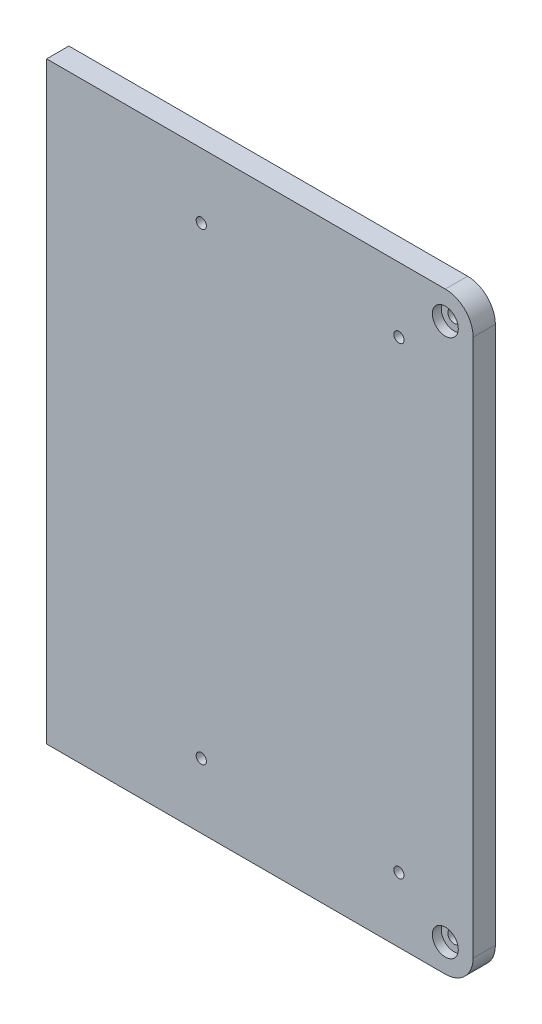
ISO-10303-21;
HEADER;
FILE_DESCRIPTION(('STEP AP214'),'2;1');
FILE_NAME('part.step','',(''),(''),'','','');
FILE_SCHEMA(('AUTOMOTIVE_DESIGN { 1 0 10303 214 1 1 1 1 }'));
ENDSEC;
DATA;
#1=APPLICATION_CONTEXT('core data for automotive mechanical design processes');
#2=APPLICATION_PROTOCOL_DEFINITION('international standard','automotive_design',2000,#1);
#3=PRODUCT_CONTEXT('',#1,'mechanical');
#4=PRODUCT('Part','Part','',(#3));
#5=PRODUCT_RELATED_PRODUCT_CATEGORY('part','',(#4));
#6=PRODUCT_DEFINITION_FORMATION('','',#4);
#7=PRODUCT_DEFINITION_CONTEXT('part definition',#1,'design');
#8=PRODUCT_DEFINITION('design','',#6,#7);
#9=PRODUCT_DEFINITION_SHAPE('','',#8);
#10=(LENGTH_UNIT() NAMED_UNIT(*) SI_UNIT(.MILLI.,.METRE.));
#11=(NAMED_UNIT(*) PLANE_ANGLE_UNIT() SI_UNIT($,.RADIAN.));
#12=(NAMED_UNIT(*) SI_UNIT($,.STERADIAN.) SOLID_ANGLE_UNIT());
#13=UNCERTAINTY_MEASURE_WITH_UNIT(LENGTH_MEASURE(1.E-05),#10,'distance_accuracy_value','');
#14=(GEOMETRIC_REPRESENTATION_CONTEXT(3) GLOBAL_UNCERTAINTY_ASSIGNED_CONTEXT((#13)) GLOBAL_UNIT_ASSIGNED_CONTEXT((#10,
#11,#12)) REPRESENTATION_CONTEXT('',''));
#15=CARTESIAN_POINT('',(0.,0.,0.));
#16=DIRECTION('',(0.,0.,1.));
#17=DIRECTION('',(1.,0.,0.));
#18=AXIS2_PLACEMENT_3D('',#15,#16,#17);
#19=CARTESIAN_POINT('',(-107.5,-80.,6.));
#20=DIRECTION('',(0.,1.,0.));
#21=DIRECTION('',(0.,0.,1.));
#22=AXIS2_PLACEMENT_3D('',#19,#20,#21);
#23=PLANE('',#22);
#24=DIRECTION('',(1.,0.,0.));
#25=VECTOR('',#24,1.);
#26=CARTESIAN_POINT('',(-107.5,-80.,6.));
#27=LINE('',#26,#25);
#28=CARTESIAN_POINT('',(0.,-80.,6.));
#29=VERTEX_POINT('',#28);
#30=CARTESIAN_POINT('',(107.5,-80.,6.));
#31=VERTEX_POINT('',#30);
#32=EDGE_CURVE('E84',#29,#31,#27,.T.);
#33=ORIENTED_EDGE('',*,*,#32,.F.);
#34=DIRECTION('',(0.,0.,-1.));
#35=VECTOR('',#34,1.);
#36=CARTESIAN_POINT('',(0.,-80.,10.));
#37=LINE('',#36,#35);
#38=CARTESIAN_POINT('',(0.,-80.,0.));
#39=VERTEX_POINT('',#38);
#40=EDGE_CURVE('E95',#29,#39,#37,.T.);
#41=ORIENTED_EDGE('',*,*,#40,.T.);
#42=DIRECTION('',(1.,0.,0.));
#43=VECTOR('',#42,1.);
#44=CARTESIAN_POINT('',(-107.5,-80.,0.));
#45=LINE('',#44,#43);
#46=CARTESIAN_POINT('',(107.5,-80.,0.));
#47=VERTEX_POINT('',#46);
#48=EDGE_CURVE('E102',#39,#47,#45,.T.);
#49=ORIENTED_EDGE('',*,*,#48,.T.);
#50=DIRECTION('',(0.,0.,-1.));
#51=VECTOR('',#50,1.);
#52=CARTESIAN_POINT('',(107.5,-80.,6.));
#53=LINE('',#52,#51);
#54=EDGE_CURVE('E11',#31,#47,#53,.T.);
#55=ORIENTED_EDGE('',*,*,#54,.F.);
#56=EDGE_LOOP('',(#33,#41,#49,#55));
#57=FACE_BOUND('',#56,.T.);
#58=ADVANCED_FACE('F33',(#57),#23,.F.);
#59=CARTESIAN_POINT('',(107.5,-72.5,6.));
#60=DIRECTION('',(0.,0.,-1.));
#61=DIRECTION('',(-1.,0.,0.));
#62=AXIS2_PLACEMENT_3D('',#59,#60,#61);
#63=CYLINDRICAL_SURFACE('',#62,7.5);
#64=CARTESIAN_POINT('',(107.5,-72.5,0.));
#65=DIRECTION('',(0.,0.,1.));
#66=DIRECTION('',(1.,0.,0.));
#67=AXIS2_PLACEMENT_3D('',#64,#65,#66);
#68=CIRCLE('',#67,7.5);
#69=CARTESIAN_POINT('',(115.,-72.5,0.));
#70=VERTEX_POINT('',#69);
#71=EDGE_CURVE('E108',#47,#70,#68,.T.);
#72=ORIENTED_EDGE('',*,*,#71,.T.);
#73=DIRECTION('',(0.,0.,-1.));
#74=VECTOR('',#73,1.);
#75=CARTESIAN_POINT('',(115.,-72.5,6.));
#76=LINE('',#75,#74);
#77=CARTESIAN_POINT('',(115.,-72.5,6.));
#78=VERTEX_POINT('',#77);
#79=EDGE_CURVE('E40',#78,#70,#76,.T.);
#80=ORIENTED_EDGE('',*,*,#79,.F.);
#81=CARTESIAN_POINT('',(107.5,-72.5,6.));
#82=DIRECTION('',(0.,0.,1.));
#83=DIRECTION('',(1.,0.,0.));
#84=AXIS2_PLACEMENT_3D('',#81,#82,#83);
#85=CIRCLE('',#84,7.5);
#86=EDGE_CURVE('E140',#31,#78,#85,.T.);
#87=ORIENTED_EDGE('',*,*,#86,.F.);
#88=ORIENTED_EDGE('',*,*,#54,.T.);
#89=EDGE_LOOP('',(#72,#80,#87,#88));
#90=FACE_BOUND('',#89,.T.);
#91=ADVANCED_FACE('F222',(#90),#63,.T.);
#92=CARTESIAN_POINT('',(115.,72.5,6.));
#93=DIRECTION('',(-1.,0.,0.));
#94=DIRECTION('',(0.,-1.,0.));
#95=AXIS2_PLACEMENT_3D('',#92,#93,#94);
#96=PLANE('',#95);
#97=DIRECTION('',(0.,1.,0.));
#98=VECTOR('',#97,1.);
#99=CARTESIAN_POINT('',(115.,72.5,0.));
#100=LINE('',#99,#98);
#101=CARTESIAN_POINT('',(115.,72.5,0.));
#102=VERTEX_POINT('',#101);
#103=EDGE_CURVE('E111',#70,#102,#100,.T.);
#104=ORIENTED_EDGE('',*,*,#103,.T.);
#105=DIRECTION('',(0.,0.,-1.));
#106=VECTOR('',#105,1.);
#107=CARTESIAN_POINT('',(115.,72.5,6.));
#108=LINE('',#107,#106);
#109=CARTESIAN_POINT('',(115.,72.5,6.));
#110=VERTEX_POINT('',#109);
#111=EDGE_CURVE('E126',#110,#102,#108,.T.);
#112=ORIENTED_EDGE('',*,*,#111,.F.);
#113=DIRECTION('',(0.,1.,0.));
#114=VECTOR('',#113,1.);
#115=CARTESIAN_POINT('',(115.,72.5,6.));
#116=LINE('',#115,#114);
#117=EDGE_CURVE('E133',#78,#110,#116,.T.);
#118=ORIENTED_EDGE('',*,*,#117,.F.);
#119=ORIENTED_EDGE('',*,*,#79,.T.);
#120=EDGE_LOOP('',(#104,#112,#118,#119));
#121=FACE_BOUND('',#120,.T.);
#122=ADVANCED_FACE('F131',(#121),#96,.F.);
#123=CARTESIAN_POINT('',(107.5,72.5,6.));
#124=DIRECTION('',(0.,0.,-1.));
#125=DIRECTION('',(-1.,0.,0.));
#126=AXIS2_PLACEMENT_3D('',#123,#124,#125);
#127=CYLINDRICAL_SURFACE('',#126,7.49999999999999);
#128=CARTESIAN_POINT('',(107.5,72.5,0.));
#129=DIRECTION('',(0.,0.,1.));
#130=DIRECTION('',(-1.,0.,0.));
#131=AXIS2_PLACEMENT_3D('',#128,#129,#130);
#132=CIRCLE('',#131,7.49999999999999);
#133=CARTESIAN_POINT('',(107.5,80.,0.));
#134=VERTEX_POINT('',#133);
#135=EDGE_CURVE('E77',#102,#134,#132,.T.);
#136=ORIENTED_EDGE('',*,*,#135,.T.);
#137=DIRECTION('',(0.,0.,-1.));
#138=VECTOR('',#137,1.);
#139=CARTESIAN_POINT('',(107.5,80.,6.));
#140=LINE('',#139,#138);
#141=CARTESIAN_POINT('',(107.5,80.,6.));
#142=VERTEX_POINT('',#141);
#143=EDGE_CURVE('E124',#142,#134,#140,.T.);
#144=ORIENTED_EDGE('',*,*,#143,.F.);
#145=CARTESIAN_POINT('',(107.5,72.5,6.));
#146=DIRECTION('',(0.,0.,1.));
#147=DIRECTION('',(-1.,0.,0.));
#148=AXIS2_PLACEMENT_3D('',#145,#146,#147);
#149=CIRCLE('',#148,7.49999999999999);
#150=EDGE_CURVE('E56',#110,#142,#149,.T.);
#151=ORIENTED_EDGE('',*,*,#150,.F.);
#152=ORIENTED_EDGE('',*,*,#111,.T.);
#153=EDGE_LOOP('',(#136,#144,#151,#152));
#154=FACE_BOUND('',#153,.T.);
#155=ADVANCED_FACE('F139',(#154),#127,.T.);
#156=CARTESIAN_POINT('',(-107.5,80.,6.));
#157=DIRECTION('',(0.,-1.,0.));
#158=DIRECTION('',(0.,0.,-1.));
#159=AXIS2_PLACEMENT_3D('',#156,#157,#158);
#160=PLANE('',#159);
#161=DIRECTION('',(-1.,0.,0.));
#162=VECTOR('',#161,1.);
#163=CARTESIAN_POINT('',(-107.5,80.,0.));
#164=LINE('',#163,#162);
#165=CARTESIAN_POINT('',(0.,80.,0.));
#166=VERTEX_POINT('',#165);
#167=EDGE_CURVE('E122',#134,#166,#164,.T.);
#168=ORIENTED_EDGE('',*,*,#167,.T.);
#169=DIRECTION('',(0.,0.,-1.));
#170=VECTOR('',#169,1.);
#171=CARTESIAN_POINT('',(0.,80.,10.));
#172=LINE('',#171,#170);
#173=CARTESIAN_POINT('',(0.,80.,6.));
#174=VERTEX_POINT('',#173);
#175=EDGE_CURVE('E47',#174,#166,#172,.T.);
#176=ORIENTED_EDGE('',*,*,#175,.F.);
#177=DIRECTION('',(-1.,0.,0.));
#178=VECTOR('',#177,1.);
#179=CARTESIAN_POINT('',(-107.5,80.,6.));
#180=LINE('',#179,#178);
#181=EDGE_CURVE('E117',#142,#174,#180,.T.);
#182=ORIENTED_EDGE('',*,*,#181,.F.);
#183=ORIENTED_EDGE('',*,*,#143,.T.);
#184=EDGE_LOOP('',(#168,#176,#182,#183));
#185=FACE_BOUND('',#184,.T.);
#186=ADVANCED_FACE('F137',(#185),#160,.F.);
#187=CARTESIAN_POINT('',(-107.5,-72.5,6.));
#188=DIRECTION('',(0.,0.,1.));
#189=DIRECTION('',(1.,0.,0.));
#190=AXIS2_PLACEMENT_3D('',#187,#188,#189);
#191=PLANE('',#190);
#192=DIRECTION('',(0.,1.,0.));
#193=VECTOR('',#192,1.);
#194=CARTESIAN_POINT('',(0.,-72.5,6.));
#195=LINE('',#194,#193);
#196=EDGE_CURVE('E103',#29,#174,#195,.T.);
#197=ORIENTED_EDGE('',*,*,#196,.F.);
#198=ORIENTED_EDGE('',*,*,#32,.T.);
#199=ORIENTED_EDGE('',*,*,#86,.T.);
#200=ORIENTED_EDGE('',*,*,#117,.T.);
#201=ORIENTED_EDGE('',*,*,#150,.T.);
#202=ORIENTED_EDGE('',*,*,#181,.T.);
#203=EDGE_LOOP('',(#197,#198,#199,#200,#201,#202));
#204=FACE_BOUND('',#203,.T.);
#205=CARTESIAN_POINT('',(107.5,-72.5,6.));
#206=DIRECTION('',(0.,0.,1.));
#207=DIRECTION('',(1.,0.,0.));
#208=AXIS2_PLACEMENT_3D('',#205,#206,#207);
#209=CIRCLE('',#208,3.5);
#210=CARTESIAN_POINT('',(111.,-72.5,6.));
#211=VERTEX_POINT('',#210);
#212=EDGE_CURVE('E186',#211,#211,#209,.T.);
#213=ORIENTED_EDGE('',*,*,#212,.F.);
#214=EDGE_LOOP('',(#213));
#215=FACE_BOUND('',#214,.T.);
#216=CARTESIAN_POINT('',(107.5,72.5,6.));
#217=DIRECTION('',(0.,0.,1.));
#218=DIRECTION('',(1.,0.,0.));
#219=AXIS2_PLACEMENT_3D('',#216,#217,#218);
#220=CIRCLE('',#219,3.5);
#221=CARTESIAN_POINT('',(111.,72.5,6.));
#222=VERTEX_POINT('',#221);
#223=EDGE_CURVE('E174',#222,#222,#220,.T.);
#224=ORIENTED_EDGE('',*,*,#223,.F.);
#225=EDGE_LOOP('',(#224));
#226=FACE_BOUND('',#225,.T.);
#227=CARTESIAN_POINT('',(95.,62.5,6.));
#228=DIRECTION('',(0.,0.,1.));
#229=DIRECTION('',(1.,0.,0.));
#230=AXIS2_PLACEMENT_3D('',#227,#228,#229);
#231=CIRCLE('',#230,1.375);
#232=CARTESIAN_POINT('',(96.375,62.5,6.));
#233=VERTEX_POINT('',#232);
#234=EDGE_CURVE('E147',#233,#233,#231,.T.);
#235=ORIENTED_EDGE('',*,*,#234,.F.);
#236=EDGE_LOOP('',(#235));
#237=FACE_BOUND('',#236,.T.);
#238=CARTESIAN_POINT('',(41.7,-62.5,6.));
#239=DIRECTION('',(0.,0.,1.));
#240=DIRECTION('',(1.,0.,0.));
#241=AXIS2_PLACEMENT_3D('',#238,#239,#240);
#242=CIRCLE('',#241,1.375);
#243=CARTESIAN_POINT('',(43.075,-62.5,6.));
#244=VERTEX_POINT('',#243);
#245=EDGE_CURVE('E150',#244,#244,#242,.T.);
#246=ORIENTED_EDGE('',*,*,#245,.F.);
#247=EDGE_LOOP('',(#246));
#248=FACE_BOUND('',#247,.T.);
#249=CARTESIAN_POINT('',(41.7,62.5,6.));
#250=DIRECTION('',(0.,0.,1.));
#251=DIRECTION('',(1.,0.,0.));
#252=AXIS2_PLACEMENT_3D('',#249,#250,#251);
#253=CIRCLE('',#252,1.375);
#254=CARTESIAN_POINT('',(43.075,62.5,6.));
#255=VERTEX_POINT('',#254);
#256=EDGE_CURVE('E153',#255,#255,#253,.T.);
#257=ORIENTED_EDGE('',*,*,#256,.F.);
#258=EDGE_LOOP('',(#257));
#259=FACE_BOUND('',#258,.T.);
#260=CARTESIAN_POINT('',(95.,-62.5,6.));
#261=DIRECTION('',(0.,0.,1.));
#262=DIRECTION('',(1.,0.,0.));
#263=AXIS2_PLACEMENT_3D('',#260,#261,#262);
#264=CIRCLE('',#263,1.375);
#265=CARTESIAN_POINT('',(96.375,-62.5,6.));
#266=VERTEX_POINT('',#265);
#267=EDGE_CURVE('E109',#266,#266,#264,.T.);
#268=ORIENTED_EDGE('',*,*,#267,.F.);
#269=EDGE_LOOP('',(#268));
#270=FACE_BOUND('',#269,.T.);
#271=ADVANCED_FACE('F190',(#204,#215,#226,#237,#248,#259,#270),#191,.T.);
#272=CARTESIAN_POINT('',(-107.5,-72.5,0.));
#273=DIRECTION('',(0.,0.,1.));
#274=DIRECTION('',(1.,0.,0.));
#275=AXIS2_PLACEMENT_3D('',#272,#273,#274);
#276=PLANE('',#275);
#277=CARTESIAN_POINT('',(107.5,-72.5,0.));
#278=DIRECTION('',(0.,0.,1.));
#279=DIRECTION('',(1.,0.,0.));
#280=AXIS2_PLACEMENT_3D('',#277,#278,#279);
#281=CIRCLE('',#280,1.69999999999999);
#282=CARTESIAN_POINT('',(109.2,-72.5,0.));
#283=VERTEX_POINT('',#282);
#284=EDGE_CURVE('E177',#283,#283,#281,.T.);
#285=ORIENTED_EDGE('',*,*,#284,.T.);
#286=EDGE_LOOP('',(#285));
#287=FACE_BOUND('',#286,.T.);
#288=CARTESIAN_POINT('',(107.5,72.5,0.));
#289=DIRECTION('',(0.,0.,1.));
#290=DIRECTION('',(1.,0.,0.));
#291=AXIS2_PLACEMENT_3D('',#288,#289,#290);
#292=CIRCLE('',#291,1.69999999999999);
#293=CARTESIAN_POINT('',(109.2,72.5,0.));
#294=VERTEX_POINT('',#293);
#295=EDGE_CURVE('E161',#294,#294,#292,.T.);
#296=ORIENTED_EDGE('',*,*,#295,.T.);
#297=EDGE_LOOP('',(#296));
#298=FACE_BOUND('',#297,.T.);
#299=CARTESIAN_POINT('',(95.,62.5,0.));
#300=DIRECTION('',(0.,0.,1.));
#301=DIRECTION('',(1.,0.,0.));
#302=AXIS2_PLACEMENT_3D('',#299,#300,#301);
#303=CIRCLE('',#302,1.375);
#304=CARTESIAN_POINT('',(96.375,62.5,0.));
#305=VERTEX_POINT('',#304);
#306=EDGE_CURVE('E156',#305,#305,#303,.T.);
#307=ORIENTED_EDGE('',*,*,#306,.T.);
#308=EDGE_LOOP('',(#307));
#309=FACE_BOUND('',#308,.T.);
#310=CARTESIAN_POINT('',(41.7,-62.5,0.));
#311=DIRECTION('',(0.,0.,1.));
#312=DIRECTION('',(1.,0.,0.));
#313=AXIS2_PLACEMENT_3D('',#310,#311,#312);
#314=CIRCLE('',#313,1.375);
#315=CARTESIAN_POINT('',(43.075,-62.5,0.));
#316=VERTEX_POINT('',#315);
#317=EDGE_CURVE('E160',#316,#316,#314,.T.);
#318=ORIENTED_EDGE('',*,*,#317,.T.);
#319=EDGE_LOOP('',(#318));
#320=FACE_BOUND('',#319,.T.);
#321=CARTESIAN_POINT('',(41.7,62.5,0.));
#322=DIRECTION('',(0.,0.,1.));
#323=DIRECTION('',(1.,0.,0.));
#324=AXIS2_PLACEMENT_3D('',#321,#322,#323);
#325=CIRCLE('',#324,1.375);
#326=CARTESIAN_POINT('',(43.075,62.5,0.));
#327=VERTEX_POINT('',#326);
#328=EDGE_CURVE('E157',#327,#327,#325,.T.);
#329=ORIENTED_EDGE('',*,*,#328,.T.);
#330=EDGE_LOOP('',(#329));
#331=FACE_BOUND('',#330,.T.);
#332=CARTESIAN_POINT('',(95.,-62.5,0.));
#333=DIRECTION('',(0.,0.,1.));
#334=DIRECTION('',(1.,0.,0.));
#335=AXIS2_PLACEMENT_3D('',#332,#333,#334);
#336=CIRCLE('',#335,1.375);
#337=CARTESIAN_POINT('',(96.375,-62.5,0.));
#338=VERTEX_POINT('',#337);
#339=EDGE_CURVE('E114',#338,#338,#336,.T.);
#340=ORIENTED_EDGE('',*,*,#339,.T.);
#341=EDGE_LOOP('',(#340));
#342=FACE_BOUND('',#341,.T.);
#343=ORIENTED_EDGE('',*,*,#48,.F.);
#344=DIRECTION('',(0.,-1.,0.));
#345=VECTOR('',#344,1.);
#346=CARTESIAN_POINT('',(0.,80.,0.));
#347=LINE('',#346,#345);
#348=EDGE_CURVE('E92',#166,#39,#347,.T.);
#349=ORIENTED_EDGE('',*,*,#348,.F.);
#350=ORIENTED_EDGE('',*,*,#167,.F.);
#351=ORIENTED_EDGE('',*,*,#135,.F.);
#352=ORIENTED_EDGE('',*,*,#103,.F.);
#353=ORIENTED_EDGE('',*,*,#71,.F.);
#354=EDGE_LOOP('',(#343,#349,#350,#351,#352,#353));
#355=FACE_BOUND('',#354,.T.);
#356=ADVANCED_FACE('F106',(#287,#298,#309,#320,#331,#342,#355),#276,.F.);
#357=CARTESIAN_POINT('',(95.,-62.5,0.));
#358=DIRECTION('',(0.,0.,1.));
#359=DIRECTION('',(1.,0.,0.));
#360=AXIS2_PLACEMENT_3D('',#357,#358,#359);
#361=CYLINDRICAL_SURFACE('',#360,1.375);
#362=ORIENTED_EDGE('',*,*,#267,.T.);
#363=EDGE_LOOP('',(#362));
#364=FACE_BOUND('',#363,.T.);
#365=ORIENTED_EDGE('',*,*,#339,.F.);
#366=EDGE_LOOP('',(#365));
#367=FACE_BOUND('',#366,.T.);
#368=ADVANCED_FACE('F206',(#364,#367),#361,.F.);
#369=CARTESIAN_POINT('',(41.7,62.5,0.));
#370=DIRECTION('',(0.,0.,1.));
#371=DIRECTION('',(1.,0.,0.));
#372=AXIS2_PLACEMENT_3D('',#369,#370,#371);
#373=CYLINDRICAL_SURFACE('',#372,1.375);
#374=ORIENTED_EDGE('',*,*,#256,.T.);
#375=EDGE_LOOP('',(#374));
#376=FACE_BOUND('',#375,.T.);
#377=ORIENTED_EDGE('',*,*,#328,.F.);
#378=EDGE_LOOP('',(#377));
#379=FACE_BOUND('',#378,.T.);
#380=ADVANCED_FACE('F209',(#376,#379),#373,.F.);
#381=CARTESIAN_POINT('',(41.7,-62.5,0.));
#382=DIRECTION('',(0.,0.,1.));
#383=DIRECTION('',(1.,0.,0.));
#384=AXIS2_PLACEMENT_3D('',#381,#382,#383);
#385=CYLINDRICAL_SURFACE('',#384,1.375);
#386=ORIENTED_EDGE('',*,*,#245,.T.);
#387=EDGE_LOOP('',(#386));
#388=FACE_BOUND('',#387,.T.);
#389=ORIENTED_EDGE('',*,*,#317,.F.);
#390=EDGE_LOOP('',(#389));
#391=FACE_BOUND('',#390,.T.);
#392=ADVANCED_FACE('F257',(#388,#391),#385,.F.);
#393=CARTESIAN_POINT('',(95.,62.5,0.));
#394=DIRECTION('',(0.,0.,1.));
#395=DIRECTION('',(1.,0.,0.));
#396=AXIS2_PLACEMENT_3D('',#393,#394,#395);
#397=CYLINDRICAL_SURFACE('',#396,1.375);
#398=ORIENTED_EDGE('',*,*,#234,.T.);
#399=EDGE_LOOP('',(#398));
#400=FACE_BOUND('',#399,.T.);
#401=ORIENTED_EDGE('',*,*,#306,.F.);
#402=EDGE_LOOP('',(#401));
#403=FACE_BOUND('',#402,.T.);
#404=ADVANCED_FACE('F265',(#400,#403),#397,.F.);
#405=CARTESIAN_POINT('',(107.5,72.5,6.));
#406=DIRECTION('',(0.,0.,1.));
#407=DIRECTION('',(1.,0.,0.));
#408=AXIS2_PLACEMENT_3D('',#405,#406,#407);
#409=CYLINDRICAL_SURFACE('',#408,1.7);
#410=ORIENTED_EDGE('',*,*,#295,.F.);
#411=EDGE_LOOP('',(#410));
#412=FACE_BOUND('',#411,.T.);
#413=CARTESIAN_POINT('',(107.5,72.5,3.6));
#414=DIRECTION('',(0.,0.,1.));
#415=DIRECTION('',(1.,0.,0.));
#416=AXIS2_PLACEMENT_3D('',#413,#414,#415);
#417=CIRCLE('',#416,1.70000000000001);
#418=CARTESIAN_POINT('',(109.2,72.5,3.6));
#419=VERTEX_POINT('',#418);
#420=EDGE_CURVE('E168',#419,#419,#417,.T.);
#421=ORIENTED_EDGE('',*,*,#420,.T.);
#422=EDGE_LOOP('',(#421));
#423=FACE_BOUND('',#422,.T.);
#424=ADVANCED_FACE('F273',(#412,#423),#409,.F.);
#425=CARTESIAN_POINT('',(109.2,72.5,3.6));
#426=DIRECTION('',(0.,0.,-1.));
#427=DIRECTION('',(-1.,0.,0.));
#428=AXIS2_PLACEMENT_3D('',#425,#426,#427);
#429=PLANE('',#428);
#430=ORIENTED_EDGE('',*,*,#420,.F.);
#431=EDGE_LOOP('',(#430));
#432=FACE_BOUND('',#431,.T.);
#433=CARTESIAN_POINT('',(107.5,72.5,3.6));
#434=DIRECTION('',(0.,0.,1.));
#435=DIRECTION('',(1.,0.,0.));
#436=AXIS2_PLACEMENT_3D('',#433,#434,#435);
#437=CIRCLE('',#436,3.5);
#438=CARTESIAN_POINT('',(111.,72.5,3.6));
#439=VERTEX_POINT('',#438);
#440=EDGE_CURVE('E171',#439,#439,#437,.T.);
#441=ORIENTED_EDGE('',*,*,#440,.T.);
#442=EDGE_LOOP('',(#441));
#443=FACE_BOUND('',#442,.T.);
#444=ADVANCED_FACE('F281',(#432,#443),#429,.F.);
#445=CARTESIAN_POINT('',(107.5,72.5,6.));
#446=DIRECTION('',(0.,0.,1.));
#447=DIRECTION('',(1.,0.,0.));
#448=AXIS2_PLACEMENT_3D('',#445,#446,#447);
#449=CYLINDRICAL_SURFACE('',#448,3.5);
#450=ORIENTED_EDGE('',*,*,#440,.F.);
#451=EDGE_LOOP('',(#450));
#452=FACE_BOUND('',#451,.T.);
#453=ORIENTED_EDGE('',*,*,#223,.T.);
#454=EDGE_LOOP('',(#453));
#455=FACE_BOUND('',#454,.T.);
#456=ADVANCED_FACE('F289',(#452,#455),#449,.F.);
#457=CARTESIAN_POINT('',(107.5,-72.5,6.));
#458=DIRECTION('',(0.,0.,1.));
#459=DIRECTION('',(1.,0.,0.));
#460=AXIS2_PLACEMENT_3D('',#457,#458,#459);
#461=CYLINDRICAL_SURFACE('',#460,1.7);
#462=ORIENTED_EDGE('',*,*,#284,.F.);
#463=EDGE_LOOP('',(#462));
#464=FACE_BOUND('',#463,.T.);
#465=CARTESIAN_POINT('',(107.5,-72.5,3.6));
#466=DIRECTION('',(0.,0.,1.));
#467=DIRECTION('',(1.,0.,0.));
#468=AXIS2_PLACEMENT_3D('',#465,#466,#467);
#469=CIRCLE('',#468,1.70000000000001);
#470=CARTESIAN_POINT('',(109.2,-72.5,3.6));
#471=VERTEX_POINT('',#470);
#472=EDGE_CURVE('E180',#471,#471,#469,.T.);
#473=ORIENTED_EDGE('',*,*,#472,.T.);
#474=EDGE_LOOP('',(#473));
#475=FACE_BOUND('',#474,.T.);
#476=ADVANCED_FACE('F297',(#464,#475),#461,.F.);
#477=CARTESIAN_POINT('',(109.2,-72.5,3.6));
#478=DIRECTION('',(0.,0.,-1.));
#479=DIRECTION('',(-1.,0.,0.));
#480=AXIS2_PLACEMENT_3D('',#477,#478,#479);
#481=PLANE('',#480);
#482=ORIENTED_EDGE('',*,*,#472,.F.);
#483=EDGE_LOOP('',(#482));
#484=FACE_BOUND('',#483,.T.);
#485=CARTESIAN_POINT('',(107.5,-72.5,3.6));
#486=DIRECTION('',(0.,0.,1.));
#487=DIRECTION('',(1.,0.,0.));
#488=AXIS2_PLACEMENT_3D('',#485,#486,#487);
#489=CIRCLE('',#488,3.5);
#490=CARTESIAN_POINT('',(111.,-72.5,3.6));
#491=VERTEX_POINT('',#490);
#492=EDGE_CURVE('E183',#491,#491,#489,.T.);
#493=ORIENTED_EDGE('',*,*,#492,.T.);
#494=EDGE_LOOP('',(#493));
#495=FACE_BOUND('',#494,.T.);
#496=ADVANCED_FACE('F305',(#484,#495),#481,.F.);
#497=CARTESIAN_POINT('',(107.5,-72.5,6.));
#498=DIRECTION('',(0.,0.,1.));
#499=DIRECTION('',(1.,0.,0.));
#500=AXIS2_PLACEMENT_3D('',#497,#498,#499);
#501=CYLINDRICAL_SURFACE('',#500,3.5);
#502=ORIENTED_EDGE('',*,*,#492,.F.);
#503=EDGE_LOOP('',(#502));
#504=FACE_BOUND('',#503,.T.);
#505=ORIENTED_EDGE('',*,*,#212,.T.);
#506=EDGE_LOOP('',(#505));
#507=FACE_BOUND('',#506,.T.);
#508=ADVANCED_FACE('F313',(#504,#507),#501,.F.);
#509=CARTESIAN_POINT('',(0.,80.,10.));
#510=DIRECTION('',(1.,0.,0.));
#511=DIRECTION('',(0.,1.,0.));
#512=AXIS2_PLACEMENT_3D('',#509,#510,#511);
#513=PLANE('',#512);
#514=ORIENTED_EDGE('',*,*,#196,.T.);
#515=ORIENTED_EDGE('',*,*,#175,.T.);
#516=ORIENTED_EDGE('',*,*,#348,.T.);
#517=ORIENTED_EDGE('',*,*,#40,.F.);
#518=EDGE_LOOP('',(#514,#515,#516,#517));
#519=FACE_BOUND('',#518,.T.);
#520=ADVANCED_FACE('F94',(#519),#513,.F.);
#521=CLOSED_SHELL('',(#58,#91,#122,#155,#186,#271,#356,#368,#380,#392,#404,#424,#444,#456,#476,
#496,#508,#520));
#522=MANIFOLD_SOLID_BREP('B2',#521);
#523=ADVANCED_BREP_SHAPE_REPRESENTATION('',(#18,#522),#14);
#524=SHAPE_DEFINITION_REPRESENTATION(#9,#523);
ENDSEC;
END-ISO-10303-21;
